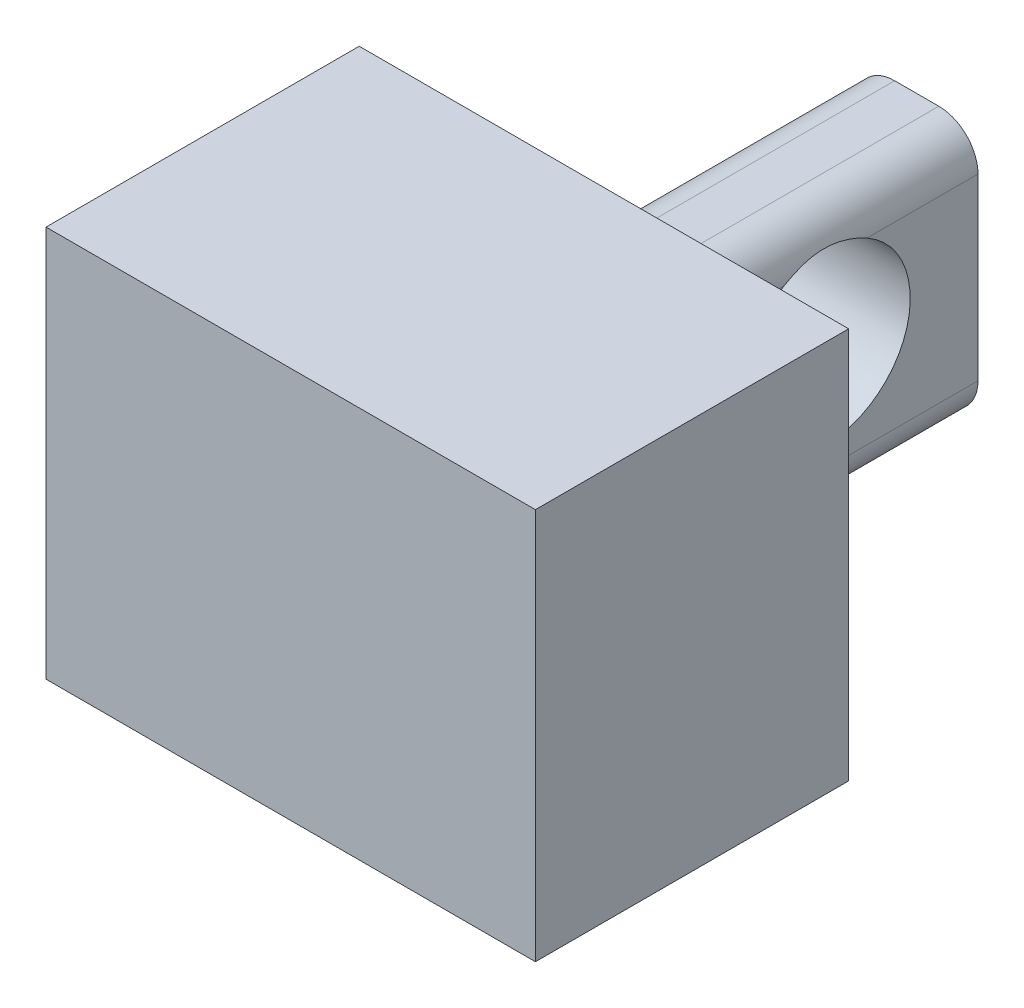
ISO-10303-21;
HEADER;
FILE_DESCRIPTION(('STEP AP214'),'2;1');
FILE_NAME('part.step','',(''),(''),'','','');
FILE_SCHEMA(('AUTOMOTIVE_DESIGN { 1 0 10303 214 1 1 1 1 }'));
ENDSEC;
DATA;
#1=APPLICATION_CONTEXT('core data for automotive mechanical design processes');
#2=APPLICATION_PROTOCOL_DEFINITION('international standard','automotive_design',2000,#1);
#3=PRODUCT_CONTEXT('',#1,'mechanical');
#4=PRODUCT('Part','Part','',(#3));
#5=PRODUCT_RELATED_PRODUCT_CATEGORY('part','',(#4));
#6=PRODUCT_DEFINITION_FORMATION('','',#4);
#7=PRODUCT_DEFINITION_CONTEXT('part definition',#1,'design');
#8=PRODUCT_DEFINITION('design','',#6,#7);
#9=PRODUCT_DEFINITION_SHAPE('','',#8);
#10=(LENGTH_UNIT() NAMED_UNIT(*) SI_UNIT(.MILLI.,.METRE.));
#11=(NAMED_UNIT(*) PLANE_ANGLE_UNIT() SI_UNIT($,.RADIAN.));
#12=(NAMED_UNIT(*) SI_UNIT($,.STERADIAN.) SOLID_ANGLE_UNIT());
#13=UNCERTAINTY_MEASURE_WITH_UNIT(LENGTH_MEASURE(1.E-05),#10,'distance_accuracy_value','');
#14=(GEOMETRIC_REPRESENTATION_CONTEXT(3) GLOBAL_UNCERTAINTY_ASSIGNED_CONTEXT((#13)) GLOBAL_UNIT_ASSIGNED_CONTEXT((#10,
#11,#12)) REPRESENTATION_CONTEXT('',''));
#15=CARTESIAN_POINT('',(0.,0.,0.));
#16=DIRECTION('',(0.,0.,1.));
#17=DIRECTION('',(1.,0.,0.));
#18=AXIS2_PLACEMENT_3D('',#15,#16,#17);
#19=CARTESIAN_POINT('',(-26.355959564323,-3.50790727902946,0.8));
#20=DIRECTION('',(1.,0.,0.));
#21=DIRECTION('',(0.,0.,-1.));
#22=AXIS2_PLACEMENT_3D('',#19,#20,#21);
#23=PLANE('',#22);
#24=DIRECTION('',(0.,-1.,0.));
#25=VECTOR('',#24,1.);
#26=CARTESIAN_POINT('',(-26.355959564323,-3.50790727902946,0.));
#27=LINE('',#26,#25);
#28=CARTESIAN_POINT('',(-26.355959564323,-3.50790727902946,0.));
#29=VERTEX_POINT('',#28);
#30=CARTESIAN_POINT('',(-26.355959564323,-4.50790727902946,0.));
#31=VERTEX_POINT('',#30);
#32=EDGE_CURVE('E154',#29,#31,#27,.T.);
#33=ORIENTED_EDGE('',*,*,#32,.T.);
#34=DIRECTION('',(0.,0.,-1.));
#35=VECTOR('',#34,1.);
#36=CARTESIAN_POINT('',(-26.355959564323,-4.50790727902946,0.8));
#37=LINE('',#36,#35);
#38=CARTESIAN_POINT('',(-26.355959564323,-4.50790727902946,0.8));
#39=VERTEX_POINT('',#38);
#40=EDGE_CURVE('E135',#39,#31,#37,.T.);
#41=ORIENTED_EDGE('',*,*,#40,.F.);
#42=DIRECTION('',(0.,-1.,0.));
#43=VECTOR('',#42,1.);
#44=CARTESIAN_POINT('',(-26.355959564323,-3.50790727902946,0.8));
#45=LINE('',#44,#43);
#46=CARTESIAN_POINT('',(-26.355959564323,-3.50790727902946,0.8));
#47=VERTEX_POINT('',#46);
#48=EDGE_CURVE('E142',#47,#39,#45,.T.);
#49=ORIENTED_EDGE('',*,*,#48,.F.);
#50=DIRECTION('',(0.,0.,-1.));
#51=VECTOR('',#50,1.);
#52=CARTESIAN_POINT('',(-26.355959564323,-3.50790727902946,0.8));
#53=LINE('',#52,#51);
#54=EDGE_CURVE('E301',#47,#29,#53,.T.);
#55=ORIENTED_EDGE('',*,*,#54,.T.);
#56=EDGE_LOOP('',(#33,#41,#49,#55));
#57=FACE_BOUND('',#56,.T.);
#58=ADVANCED_FACE('F32',(#57),#23,.F.);
#59=CARTESIAN_POINT('',(-26.355959564323,-4.50790727902946,0.8));
#60=DIRECTION('',(0.,1.,0.));
#61=DIRECTION('',(-1.,0.,0.));
#62=AXIS2_PLACEMENT_3D('',#59,#60,#61);
#63=PLANE('',#62);
#64=DIRECTION('',(1.,0.,0.));
#65=VECTOR('',#64,1.);
#66=CARTESIAN_POINT('',(-26.355959564323,-4.50790727902946,0.));
#67=LINE('',#66,#65);
#68=CARTESIAN_POINT('',(-25.105959564323,-4.50790727902946,0.));
#69=VERTEX_POINT('',#68);
#70=EDGE_CURVE('E303',#31,#69,#67,.T.);
#71=ORIENTED_EDGE('',*,*,#70,.T.);
#72=DIRECTION('',(0.,0.,-1.));
#73=VECTOR('',#72,1.);
#74=CARTESIAN_POINT('',(-25.105959564323,-4.50790727902946,0.8));
#75=LINE('',#74,#73);
#76=CARTESIAN_POINT('',(-25.105959564323,-4.50790727902946,0.8));
#77=VERTEX_POINT('',#76);
#78=EDGE_CURVE('E138',#77,#69,#75,.T.);
#79=ORIENTED_EDGE('',*,*,#78,.F.);
#80=DIRECTION('',(1.,0.,0.));
#81=VECTOR('',#80,1.);
#82=CARTESIAN_POINT('',(-26.355959564323,-4.50790727902946,0.8));
#83=LINE('',#82,#81);
#84=EDGE_CURVE('E131',#39,#77,#83,.T.);
#85=ORIENTED_EDGE('',*,*,#84,.F.);
#86=ORIENTED_EDGE('',*,*,#40,.T.);
#87=EDGE_LOOP('',(#71,#79,#85,#86));
#88=FACE_BOUND('',#87,.T.);
#89=ADVANCED_FACE('F133',(#88),#63,.F.);
#90=CARTESIAN_POINT('',(-25.105959564323,-3.50790727902946,0.8));
#91=DIRECTION('',(-1.,0.,0.));
#92=DIRECTION('',(0.,0.,1.));
#93=AXIS2_PLACEMENT_3D('',#90,#91,#92);
#94=PLANE('',#93);
#95=DIRECTION('',(0.,1.,0.));
#96=VECTOR('',#95,1.);
#97=CARTESIAN_POINT('',(-25.105959564323,-3.50790727902946,0.));
#98=LINE('',#97,#96);
#99=CARTESIAN_POINT('',(-25.105959564323,-3.50790727902946,0.));
#100=VERTEX_POINT('',#99);
#101=EDGE_CURVE('E305',#69,#100,#98,.T.);
#102=ORIENTED_EDGE('',*,*,#101,.T.);
#103=DIRECTION('',(0.,0.,-1.));
#104=VECTOR('',#103,1.);
#105=CARTESIAN_POINT('',(-25.105959564323,-3.50790727902946,0.8));
#106=LINE('',#105,#104);
#107=CARTESIAN_POINT('',(-25.105959564323,-3.50790727902946,0.8));
#108=VERTEX_POINT('',#107);
#109=EDGE_CURVE('E160',#108,#100,#106,.T.);
#110=ORIENTED_EDGE('',*,*,#109,.F.);
#111=DIRECTION('',(0.,1.,0.));
#112=VECTOR('',#111,1.);
#113=CARTESIAN_POINT('',(-25.105959564323,-3.50790727902946,0.8));
#114=LINE('',#113,#112);
#115=EDGE_CURVE('E141',#77,#108,#114,.T.);
#116=ORIENTED_EDGE('',*,*,#115,.F.);
#117=ORIENTED_EDGE('',*,*,#78,.T.);
#118=EDGE_LOOP('',(#102,#110,#116,#117));
#119=FACE_BOUND('',#118,.T.);
#120=ADVANCED_FACE('F220',(#119),#94,.F.);
#121=CARTESIAN_POINT('',(-26.355959564323,-3.50790727902946,0.8));
#122=DIRECTION('',(0.,-1.,0.));
#123=DIRECTION('',(0.,0.,-1.));
#124=AXIS2_PLACEMENT_3D('',#121,#122,#123);
#125=PLANE('',#124);
#126=DIRECTION('',(-1.,0.,0.));
#127=VECTOR('',#126,1.);
#128=CARTESIAN_POINT('',(-26.355959564323,-3.50790727902946,0.));
#129=LINE('',#128,#127);
#130=EDGE_CURVE('E151',#100,#29,#129,.T.);
#131=ORIENTED_EDGE('',*,*,#130,.T.);
#132=ORIENTED_EDGE('',*,*,#54,.F.);
#133=DIRECTION('',(-1.,0.,0.));
#134=VECTOR('',#133,1.);
#135=CARTESIAN_POINT('',(-26.355959564323,-3.50790727902946,0.8));
#136=LINE('',#135,#134);
#137=EDGE_CURVE('E147',#108,#47,#136,.T.);
#138=ORIENTED_EDGE('',*,*,#137,.F.);
#139=ORIENTED_EDGE('',*,*,#109,.T.);
#140=EDGE_LOOP('',(#131,#132,#138,#139));
#141=FACE_BOUND('',#140,.T.);
#142=ADVANCED_FACE('F225',(#141),#125,.F.);
#143=CARTESIAN_POINT('',(0.,0.,0.8));
#144=DIRECTION('',(0.,0.,1.));
#145=DIRECTION('',(1.,0.,0.));
#146=AXIS2_PLACEMENT_3D('',#143,#144,#145);
#147=PLANE('',#146);
#148=ORIENTED_EDGE('',*,*,#48,.T.);
#149=ORIENTED_EDGE('',*,*,#84,.T.);
#150=ORIENTED_EDGE('',*,*,#115,.T.);
#151=ORIENTED_EDGE('',*,*,#137,.T.);
#152=EDGE_LOOP('',(#148,#149,#150,#151));
#153=FACE_BOUND('',#152,.T.);
#154=ADVANCED_FACE('F145',(#153),#147,.T.);
#155=CARTESIAN_POINT('',(0.,0.,0.));
#156=DIRECTION('',(0.,0.,1.));
#157=DIRECTION('',(1.,0.,0.));
#158=AXIS2_PLACEMENT_3D('',#155,#156,#157);
#159=PLANE('',#158);
#160=DIRECTION('',(0.,-1.,0.));
#161=VECTOR('',#160,1.);
#162=CARTESIAN_POINT('',(-25.8883862230819,-3.70044984480901,0.));
#163=LINE('',#162,#161);
#164=CARTESIAN_POINT('',(-25.8883862230819,-3.80044984480901,0.));
#165=VERTEX_POINT('',#164);
#166=CARTESIAN_POINT('',(-25.8883862230819,-4.25762690352077,0.));
#167=VERTEX_POINT('',#166);
#168=EDGE_CURVE('E291',#165,#167,#163,.T.);
#169=ORIENTED_EDGE('',*,*,#168,.T.);
#170=CARTESIAN_POINT('',(-25.7883862230819,-4.25762690352077,0.));
#171=DIRECTION('',(0.,0.,1.));
#172=DIRECTION('',(1.,0.,0.));
#173=AXIS2_PLACEMENT_3D('',#170,#171,#172);
#174=CIRCLE('',#173,0.1);
#175=CARTESIAN_POINT('',(-25.7883862230819,-4.35762690352077,0.));
#176=VERTEX_POINT('',#175);
#177=EDGE_CURVE('E11',#167,#176,#174,.T.);
#178=ORIENTED_EDGE('',*,*,#177,.T.);
#179=DIRECTION('',(1.,0.,0.));
#180=VECTOR('',#179,1.);
#181=CARTESIAN_POINT('',(-25.8883862230819,-4.35762690352077,0.));
#182=LINE('',#181,#180);
#183=CARTESIAN_POINT('',(-25.6756460150776,-4.35762690352077,0.));
#184=VERTEX_POINT('',#183);
#185=EDGE_CURVE('E293',#176,#184,#182,.T.);
#186=ORIENTED_EDGE('',*,*,#185,.T.);
#187=CARTESIAN_POINT('',(-25.6756460150776,-4.25762690352077,0.));
#188=DIRECTION('',(0.,0.,1.));
#189=DIRECTION('',(1.,0.,0.));
#190=AXIS2_PLACEMENT_3D('',#187,#188,#189);
#191=CIRCLE('',#190,0.1);
#192=CARTESIAN_POINT('',(-25.5756460150776,-4.25762690352077,0.));
#193=VERTEX_POINT('',#192);
#194=EDGE_CURVE('E325',#184,#193,#191,.T.);
#195=ORIENTED_EDGE('',*,*,#194,.T.);
#196=DIRECTION('',(0.,1.,0.));
#197=VECTOR('',#196,1.);
#198=CARTESIAN_POINT('',(-25.5756460150776,-3.70044984480901,0.));
#199=LINE('',#198,#197);
#200=CARTESIAN_POINT('',(-25.5756460150776,-3.80044984480901,0.));
#201=VERTEX_POINT('',#200);
#202=EDGE_CURVE('E295',#193,#201,#199,.T.);
#203=ORIENTED_EDGE('',*,*,#202,.T.);
#204=CARTESIAN_POINT('',(-25.6756460150776,-3.80044984480901,0.));
#205=DIRECTION('',(0.,0.,1.));
#206=DIRECTION('',(1.,0.,0.));
#207=AXIS2_PLACEMENT_3D('',#204,#205,#206);
#208=CIRCLE('',#207,0.1);
#209=CARTESIAN_POINT('',(-25.6756460150776,-3.70044984480901,0.));
#210=VERTEX_POINT('',#209);
#211=EDGE_CURVE('E271',#201,#210,#208,.T.);
#212=ORIENTED_EDGE('',*,*,#211,.T.);
#213=DIRECTION('',(-1.,0.,0.));
#214=VECTOR('',#213,1.);
#215=CARTESIAN_POINT('',(-25.8883862230819,-3.70044984480901,0.));
#216=LINE('',#215,#214);
#217=CARTESIAN_POINT('',(-25.7883862230819,-3.70044984480901,0.));
#218=VERTEX_POINT('',#217);
#219=EDGE_CURVE('E297',#210,#218,#216,.T.);
#220=ORIENTED_EDGE('',*,*,#219,.T.);
#221=CARTESIAN_POINT('',(-25.7883862230819,-3.80044984480901,0.));
#222=DIRECTION('',(0.,0.,1.));
#223=DIRECTION('',(1.,0.,0.));
#224=AXIS2_PLACEMENT_3D('',#221,#222,#223);
#225=CIRCLE('',#224,0.1);
#226=EDGE_CURVE('E269',#218,#165,#225,.T.);
#227=ORIENTED_EDGE('',*,*,#226,.T.);
#228=EDGE_LOOP('',(#169,#178,#186,#195,#203,#212,#220,#227));
#229=FACE_BOUND('',#228,.T.);
#230=ORIENTED_EDGE('',*,*,#32,.F.);
#231=ORIENTED_EDGE('',*,*,#130,.F.);
#232=ORIENTED_EDGE('',*,*,#101,.F.);
#233=ORIENTED_EDGE('',*,*,#70,.F.);
#234=EDGE_LOOP('',(#230,#231,#232,#233));
#235=FACE_BOUND('',#234,.T.);
#236=ADVANCED_FACE('F230',(#229,#235),#159,.F.);
#237=CARTESIAN_POINT('',(-25.8883862230819,-3.70044984480901,-0.8));
#238=DIRECTION('',(-1.,0.,0.));
#239=DIRECTION('',(0.,0.,1.));
#240=AXIS2_PLACEMENT_3D('',#237,#238,#239);
#241=PLANE('',#240);
#242=DIRECTION('',(0.,-1.,0.));
#243=VECTOR('',#242,1.);
#244=CARTESIAN_POINT('',(-25.8883862230819,-3.70044984480901,-0.8));
#245=LINE('',#244,#243);
#246=CARTESIAN_POINT('',(-25.8883862230819,-3.80044984480901,-0.8));
#247=VERTEX_POINT('',#246);
#248=CARTESIAN_POINT('',(-25.8883862230819,-4.25762690352077,-0.8));
#249=VERTEX_POINT('',#248);
#250=EDGE_CURVE('E287',#247,#249,#245,.T.);
#251=ORIENTED_EDGE('',*,*,#250,.T.);
#252=DIRECTION('',(0.,0.,1.));
#253=VECTOR('',#252,1.);
#254=CARTESIAN_POINT('',(-25.8883862230819,-4.25762690352077,-0.8));
#255=LINE('',#254,#253);
#256=EDGE_CURVE('E321',#249,#167,#255,.T.);
#257=ORIENTED_EDGE('',*,*,#256,.T.);
#258=ORIENTED_EDGE('',*,*,#168,.F.);
#259=DIRECTION('',(0.,0.,1.));
#260=VECTOR('',#259,1.);
#261=CARTESIAN_POINT('',(-25.8883862230819,-3.80044984480901,-0.8));
#262=LINE('',#261,#260);
#263=CARTESIAN_POINT('',(-25.8883862230819,-3.80044984480901,-0.304310312918235));
#264=VERTEX_POINT('',#263);
#265=EDGE_CURVE('E201',#165,#264,#262,.F.);
#266=ORIENTED_EDGE('',*,*,#265,.T.);
#267=CARTESIAN_POINT('',(-25.8883862230819,-3.9889999549132,-0.410542062383001));
#268=DIRECTION('',(-1.,0.,0.));
#269=DIRECTION('',(0.,0.,1.));
#270=AXIS2_PLACEMENT_3D('',#267,#268,#269);
#271=CIRCLE('',#270,0.216417024780042);
#272=CARTESIAN_POINT('',(-25.8883862230819,-3.80044984480901,-0.516773811847768));
#273=VERTEX_POINT('',#272);
#274=EDGE_CURVE('E166',#273,#264,#271,.T.);
#275=ORIENTED_EDGE('',*,*,#274,.F.);
#276=DIRECTION('',(0.,0.,1.));
#277=VECTOR('',#276,1.);
#278=CARTESIAN_POINT('',(-25.8883862230819,-3.80044984480901,-0.8));
#279=LINE('',#278,#277);
#280=EDGE_CURVE('E270',#273,#247,#279,.F.);
#281=ORIENTED_EDGE('',*,*,#280,.T.);
#282=EDGE_LOOP('',(#251,#257,#258,#266,#275,#281));
#283=FACE_BOUND('',#282,.T.);
#284=ADVANCED_FACE('F233',(#283),#241,.T.);
#285=CARTESIAN_POINT('',(-25.8883862230819,-3.70044984480901,-0.8));
#286=DIRECTION('',(0.,1.,0.));
#287=DIRECTION('',(0.,0.,1.));
#288=AXIS2_PLACEMENT_3D('',#285,#286,#287);
#289=PLANE('',#288);
#290=DIRECTION('',(-1.,0.,0.));
#291=VECTOR('',#290,1.);
#292=CARTESIAN_POINT('',(-25.8883862230819,-3.70044984480901,-0.8));
#293=LINE('',#292,#291);
#294=CARTESIAN_POINT('',(-25.6756460150776,-3.70044984480901,-0.8));
#295=VERTEX_POINT('',#294);
#296=CARTESIAN_POINT('',(-25.7883862230819,-3.70044984480901,-0.8));
#297=VERTEX_POINT('',#296);
#298=EDGE_CURVE('E253',#295,#297,#293,.T.);
#299=ORIENTED_EDGE('',*,*,#298,.T.);
#300=DIRECTION('',(0.,0.,1.));
#301=VECTOR('',#300,1.);
#302=CARTESIAN_POINT('',(-25.7883862230819,-3.70044984480901,-0.8));
#303=LINE('',#302,#301);
#304=EDGE_CURVE('E256',#297,#218,#303,.T.);
#305=ORIENTED_EDGE('',*,*,#304,.T.);
#306=ORIENTED_EDGE('',*,*,#219,.F.);
#307=DIRECTION('',(0.,0.,1.));
#308=VECTOR('',#307,1.);
#309=CARTESIAN_POINT('',(-25.6756460150776,-3.70044984480901,-0.8));
#310=LINE('',#309,#308);
#311=EDGE_CURVE('E178',#210,#295,#310,.F.);
#312=ORIENTED_EDGE('',*,*,#311,.T.);
#313=EDGE_LOOP('',(#299,#305,#306,#312));
#314=FACE_BOUND('',#313,.T.);
#315=ADVANCED_FACE('F238',(#314),#289,.T.);
#316=CARTESIAN_POINT('',(-25.5756460150776,-3.70044984480901,-0.8));
#317=DIRECTION('',(1.,0.,0.));
#318=DIRECTION('',(0.,0.,-1.));
#319=AXIS2_PLACEMENT_3D('',#316,#317,#318);
#320=PLANE('',#319);
#321=ORIENTED_EDGE('',*,*,#202,.F.);
#322=DIRECTION('',(0.,0.,1.));
#323=VECTOR('',#322,1.);
#324=CARTESIAN_POINT('',(-25.5756460150776,-4.25762690352077,-0.8));
#325=LINE('',#324,#323);
#326=CARTESIAN_POINT('',(-25.5756460150776,-4.25762690352077,-0.8));
#327=VERTEX_POINT('',#326);
#328=EDGE_CURVE('E284',#193,#327,#325,.F.);
#329=ORIENTED_EDGE('',*,*,#328,.T.);
#330=DIRECTION('',(0.,1.,0.));
#331=VECTOR('',#330,1.);
#332=CARTESIAN_POINT('',(-25.5756460150776,-3.70044984480901,-0.8));
#333=LINE('',#332,#331);
#334=CARTESIAN_POINT('',(-25.5756460150776,-3.80044984480901,-0.8));
#335=VERTEX_POINT('',#334);
#336=EDGE_CURVE('E262',#327,#335,#333,.T.);
#337=ORIENTED_EDGE('',*,*,#336,.T.);
#338=DIRECTION('',(0.,0.,1.));
#339=VECTOR('',#338,1.);
#340=CARTESIAN_POINT('',(-25.5756460150776,-3.80044984480901,-0.8));
#341=LINE('',#340,#339);
#342=CARTESIAN_POINT('',(-25.5756460150776,-3.80044984480901,-0.516773811847768));
#343=VERTEX_POINT('',#342);
#344=EDGE_CURVE('E158',#335,#343,#341,.T.);
#345=ORIENTED_EDGE('',*,*,#344,.T.);
#346=CARTESIAN_POINT('',(-25.5756460150776,-3.9889999549132,-0.410542062383001));
#347=DIRECTION('',(1.,0.,0.));
#348=DIRECTION('',(0.,0.,-1.));
#349=AXIS2_PLACEMENT_3D('',#346,#347,#348);
#350=CIRCLE('',#349,0.216417024780042);
#351=CARTESIAN_POINT('',(-25.5756460150776,-3.80044984480901,-0.304310312918235));
#352=VERTEX_POINT('',#351);
#353=EDGE_CURVE('E164',#352,#343,#350,.T.);
#354=ORIENTED_EDGE('',*,*,#353,.F.);
#355=DIRECTION('',(0.,0.,1.));
#356=VECTOR('',#355,1.);
#357=CARTESIAN_POINT('',(-25.5756460150776,-3.80044984480901,-0.8));
#358=LINE('',#357,#356);
#359=EDGE_CURVE('E155',#352,#201,#358,.T.);
#360=ORIENTED_EDGE('',*,*,#359,.T.);
#361=EDGE_LOOP('',(#321,#329,#337,#345,#354,#360));
#362=FACE_BOUND('',#361,.T.);
#363=ADVANCED_FACE('F243',(#362),#320,.T.);
#364=CARTESIAN_POINT('',(-25.8883862230819,-4.35762690352077,-0.8));
#365=DIRECTION('',(0.,-1.,0.));
#366=DIRECTION('',(0.,0.,-1.));
#367=AXIS2_PLACEMENT_3D('',#364,#365,#366);
#368=PLANE('',#367);
#369=ORIENTED_EDGE('',*,*,#185,.F.);
#370=DIRECTION('',(0.,0.,1.));
#371=VECTOR('',#370,1.);
#372=CARTESIAN_POINT('',(-25.7883862230819,-4.35762690352077,-0.8));
#373=LINE('',#372,#371);
#374=CARTESIAN_POINT('',(-25.7883862230819,-4.35762690352077,-0.8));
#375=VERTEX_POINT('',#374);
#376=EDGE_CURVE('E52',#176,#375,#373,.F.);
#377=ORIENTED_EDGE('',*,*,#376,.T.);
#378=DIRECTION('',(1.,0.,0.));
#379=VECTOR('',#378,1.);
#380=CARTESIAN_POINT('',(-25.8883862230819,-4.35762690352077,-0.8));
#381=LINE('',#380,#379);
#382=CARTESIAN_POINT('',(-25.6756460150776,-4.35762690352077,-0.8));
#383=VERTEX_POINT('',#382);
#384=EDGE_CURVE('E285',#375,#383,#381,.T.);
#385=ORIENTED_EDGE('',*,*,#384,.T.);
#386=DIRECTION('',(0.,0.,1.));
#387=VECTOR('',#386,1.);
#388=CARTESIAN_POINT('',(-25.6756460150776,-4.35762690352077,-0.8));
#389=LINE('',#388,#387);
#390=EDGE_CURVE('E329',#383,#184,#389,.T.);
#391=ORIENTED_EDGE('',*,*,#390,.T.);
#392=EDGE_LOOP('',(#369,#377,#385,#391));
#393=FACE_BOUND('',#392,.T.);
#394=ADVANCED_FACE('F240',(#393),#368,.T.);
#395=CARTESIAN_POINT('',(0.,0.,-0.8));
#396=DIRECTION('',(0.,0.,1.));
#397=DIRECTION('',(1.,0.,0.));
#398=AXIS2_PLACEMENT_3D('',#395,#396,#397);
#399=PLANE('',#398);
#400=ORIENTED_EDGE('',*,*,#384,.F.);
#401=CARTESIAN_POINT('',(-25.7883862230819,-4.25762690352077,-0.8));
#402=DIRECTION('',(0.,0.,1.));
#403=DIRECTION('',(1.,0.,0.));
#404=AXIS2_PLACEMENT_3D('',#401,#402,#403);
#405=CIRCLE('',#404,0.1);
#406=EDGE_CURVE('E40',#375,#249,#405,.F.);
#407=ORIENTED_EDGE('',*,*,#406,.T.);
#408=ORIENTED_EDGE('',*,*,#250,.F.);
#409=CARTESIAN_POINT('',(-25.7883862230819,-3.80044984480901,-0.8));
#410=DIRECTION('',(0.,0.,1.));
#411=DIRECTION('',(1.,0.,0.));
#412=AXIS2_PLACEMENT_3D('',#409,#410,#411);
#413=CIRCLE('',#412,0.1);
#414=EDGE_CURVE('E267',#247,#297,#413,.F.);
#415=ORIENTED_EDGE('',*,*,#414,.T.);
#416=ORIENTED_EDGE('',*,*,#298,.F.);
#417=CARTESIAN_POINT('',(-25.6756460150776,-3.80044984480901,-0.8));
#418=DIRECTION('',(0.,0.,1.));
#419=DIRECTION('',(1.,0.,0.));
#420=AXIS2_PLACEMENT_3D('',#417,#418,#419);
#421=CIRCLE('',#420,0.1);
#422=EDGE_CURVE('E273',#295,#335,#421,.F.);
#423=ORIENTED_EDGE('',*,*,#422,.T.);
#424=ORIENTED_EDGE('',*,*,#336,.F.);
#425=CARTESIAN_POINT('',(-25.6756460150776,-4.25762690352077,-0.8));
#426=DIRECTION('',(0.,0.,1.));
#427=DIRECTION('',(1.,0.,0.));
#428=AXIS2_PLACEMENT_3D('',#425,#426,#427);
#429=CIRCLE('',#428,0.1);
#430=EDGE_CURVE('E200',#327,#383,#429,.F.);
#431=ORIENTED_EDGE('',*,*,#430,.T.);
#432=EDGE_LOOP('',(#400,#407,#408,#415,#416,#423,#424,#431));
#433=FACE_BOUND('',#432,.T.);
#434=ADVANCED_FACE('F188',(#433),#399,.F.);
#435=CARTESIAN_POINT('',(-26.355959564323,-3.9889999549132,-0.410542062383001));
#436=DIRECTION('',(1.,0.,0.));
#437=DIRECTION('',(0.,0.,-1.));
#438=AXIS2_PLACEMENT_3D('',#435,#436,#437);
#439=CYLINDRICAL_SURFACE('',#438,0.216417024780042);
#440=ORIENTED_EDGE('',*,*,#274,.T.);
#441=CARTESIAN_POINT('',(-25.8883862230819,-3.80044984480901,-0.304310312918235));
#442=CARTESIAN_POINT('',(-25.8883469258863,-3.79463977040355,-0.314611715616769));
#443=CARTESIAN_POINT('',(-25.8878795787397,-3.78969454157959,-0.325374449602599));
#444=CARTESIAN_POINT('',(-25.8866924474322,-3.78161924498684,-0.347548574495071));
#445=CARTESIAN_POINT('',(-25.8859726933778,-3.77848896085442,-0.358959887904938));
#446=CARTESIAN_POINT('',(-25.8848758171797,-3.77409435685497,-0.382336573066874));
#447=CARTESIAN_POINT('',(-25.8845040850914,-3.7728592076463,-0.394307738969369));
#448=CARTESIAN_POINT('',(-25.8843699028371,-3.77238980732659,-0.418292429082887));
#449=CARTESIAN_POINT('',(-25.8846073413727,-3.77315519070892,-0.430305945155837));
#450=CARTESIAN_POINT('',(-25.8855223262338,-3.77662705529428,-0.453825561441156));
#451=CARTESIAN_POINT('',(-25.8861927405915,-3.77930215365993,-0.465336712887157));
#452=CARTESIAN_POINT('',(-25.8874736486897,-3.7864866342729,-0.487759940945278));
#453=CARTESIAN_POINT('',(-25.8880842730116,-3.79099190328385,-0.498673299062766));
#454=CARTESIAN_POINT('',(-25.8883556397998,-3.79766561645269,-0.511714837527523));
#455=CARTESIAN_POINT('',(-25.8883854577382,-3.7990324993448,-0.514258818837068));
#456=CARTESIAN_POINT('',(-25.8883862230819,-3.80044984480901,-0.516773811847768));
#457=B_SPLINE_CURVE_WITH_KNOTS('',3,(#441,#442,#443,#444,#445,#446,#447,#448,#449,#450,#451,
#452,#453,#454,#455,#456),.UNSPECIFIED.,.F.,.F.,(4,2,2,2,2,2,2,4),(0.,0.0354089139768964,
0.0708136059092501,0.106757979620633,0.142695786586341,0.178056224025151,0.213337626114102,
0.221999368472806),.UNSPECIFIED.);
#458=EDGE_CURVE('E193',#264,#273,#457,.T.);
#459=ORIENTED_EDGE('',*,*,#458,.T.);
#460=EDGE_LOOP('',(#440,#459));
#461=FACE_BOUND('',#460,.T.);
#462=ORIENTED_EDGE('',*,*,#353,.T.);
#463=CARTESIAN_POINT('',(-25.5756460150776,-3.80044984480901,-0.516773811847768));
#464=CARTESIAN_POINT('',(-25.5756853122732,-3.79463977040355,-0.506472409149234));
#465=CARTESIAN_POINT('',(-25.5761526594198,-3.78969454157959,-0.495709675163404));
#466=CARTESIAN_POINT('',(-25.5773397907273,-3.78161924498684,-0.473535550270932));
#467=CARTESIAN_POINT('',(-25.5780595447817,-3.77848896085442,-0.462124236861064));
#468=CARTESIAN_POINT('',(-25.5791564209798,-3.77409435685497,-0.438747551699128));
#469=CARTESIAN_POINT('',(-25.5795281530682,-3.7728592076463,-0.426776385796633));
#470=CARTESIAN_POINT('',(-25.5796623353224,-3.77238980732659,-0.402791695683115));
#471=CARTESIAN_POINT('',(-25.5794248967868,-3.77315519070892,-0.390778179610165));
#472=CARTESIAN_POINT('',(-25.5785099119257,-3.77662705529428,-0.367258563324847));
#473=CARTESIAN_POINT('',(-25.5778394975681,-3.77930215365993,-0.355747411878846));
#474=CARTESIAN_POINT('',(-25.5765585894699,-3.7864866342729,-0.333324183820725));
#475=CARTESIAN_POINT('',(-25.5759479651479,-3.79099190328385,-0.322410825703237));
#476=CARTESIAN_POINT('',(-25.5756765983598,-3.79766561645269,-0.30936928723848));
#477=CARTESIAN_POINT('',(-25.5756467804213,-3.7990324993448,-0.306825305928935));
#478=CARTESIAN_POINT('',(-25.5756460150776,-3.80044984480901,-0.304310312918235));
#479=B_SPLINE_CURVE_WITH_KNOTS('',3,(#463,#464,#465,#466,#467,#468,#469,#470,#471,#472,#473,
#474,#475,#476,#477,#478),.UNSPECIFIED.,.F.,.F.,(4,2,2,2,2,2,2,4),(0.,0.0354089139768964,
0.0708136059092501,0.106757979620633,0.142695786586341,0.17805622402515,0.213337626114102,
0.221999368472806),.UNSPECIFIED.);
#480=EDGE_CURVE('E170',#343,#352,#479,.T.);
#481=ORIENTED_EDGE('',*,*,#480,.T.);
#482=EDGE_LOOP('',(#462,#481));
#483=FACE_BOUND('',#482,.T.);
#484=ADVANCED_FACE('F184',(#461,#483),#439,.F.);
#485=CARTESIAN_POINT('',(-25.6756460150776,-3.80044984480901,-0.8));
#486=DIRECTION('',(0.,0.,1.));
#487=DIRECTION('',(1.,0.,0.));
#488=AXIS2_PLACEMENT_3D('',#485,#486,#487);
#489=CYLINDRICAL_SURFACE('',#488,0.1);
#490=ORIENTED_EDGE('',*,*,#422,.F.);
#491=ORIENTED_EDGE('',*,*,#311,.F.);
#492=ORIENTED_EDGE('',*,*,#211,.F.);
#493=ORIENTED_EDGE('',*,*,#359,.F.);
#494=ORIENTED_EDGE('',*,*,#480,.F.);
#495=ORIENTED_EDGE('',*,*,#344,.F.);
#496=EDGE_LOOP('',(#490,#491,#492,#493,#494,#495));
#497=FACE_BOUND('',#496,.T.);
#498=ADVANCED_FACE('F180',(#497),#489,.T.);
#499=CARTESIAN_POINT('',(-25.7883862230819,-3.80044984480901,-0.8));
#500=DIRECTION('',(0.,0.,1.));
#501=DIRECTION('',(1.,0.,0.));
#502=AXIS2_PLACEMENT_3D('',#499,#500,#501);
#503=CYLINDRICAL_SURFACE('',#502,0.1);
#504=ORIENTED_EDGE('',*,*,#458,.F.);
#505=ORIENTED_EDGE('',*,*,#265,.F.);
#506=ORIENTED_EDGE('',*,*,#226,.F.);
#507=ORIENTED_EDGE('',*,*,#304,.F.);
#508=ORIENTED_EDGE('',*,*,#414,.F.);
#509=ORIENTED_EDGE('',*,*,#280,.F.);
#510=EDGE_LOOP('',(#504,#505,#506,#507,#508,#509));
#511=FACE_BOUND('',#510,.T.);
#512=ADVANCED_FACE('F204',(#511),#503,.T.);
#513=CARTESIAN_POINT('',(-25.6756460150776,-4.25762690352077,-0.8));
#514=DIRECTION('',(0.,0.,1.));
#515=DIRECTION('',(1.,0.,0.));
#516=AXIS2_PLACEMENT_3D('',#513,#514,#515);
#517=CYLINDRICAL_SURFACE('',#516,0.1);
#518=ORIENTED_EDGE('',*,*,#430,.F.);
#519=ORIENTED_EDGE('',*,*,#328,.F.);
#520=ORIENTED_EDGE('',*,*,#194,.F.);
#521=ORIENTED_EDGE('',*,*,#390,.F.);
#522=EDGE_LOOP('',(#518,#519,#520,#521));
#523=FACE_BOUND('',#522,.T.);
#524=ADVANCED_FACE('F207',(#523),#517,.T.);
#525=CARTESIAN_POINT('',(-25.7883862230819,-4.25762690352077,-0.8));
#526=DIRECTION('',(0.,0.,1.));
#527=DIRECTION('',(1.,0.,0.));
#528=AXIS2_PLACEMENT_3D('',#525,#526,#527);
#529=CYLINDRICAL_SURFACE('',#528,0.1);
#530=ORIENTED_EDGE('',*,*,#406,.F.);
#531=ORIENTED_EDGE('',*,*,#376,.F.);
#532=ORIENTED_EDGE('',*,*,#177,.F.);
#533=ORIENTED_EDGE('',*,*,#256,.F.);
#534=EDGE_LOOP('',(#530,#531,#532,#533));
#535=FACE_BOUND('',#534,.T.);
#536=ADVANCED_FACE('F34',(#535),#529,.T.);
#537=CLOSED_SHELL('',(#58,#89,#120,#142,#154,#236,#284,#315,#363,#394,#434,#484,#498,#512,#524,#536));
#538=MANIFOLD_SOLID_BREP('B2',#537);
#539=ADVANCED_BREP_SHAPE_REPRESENTATION('',(#18,#538),#14);
#540=SHAPE_DEFINITION_REPRESENTATION(#9,#539);
ENDSEC;
END-ISO-10303-21;
